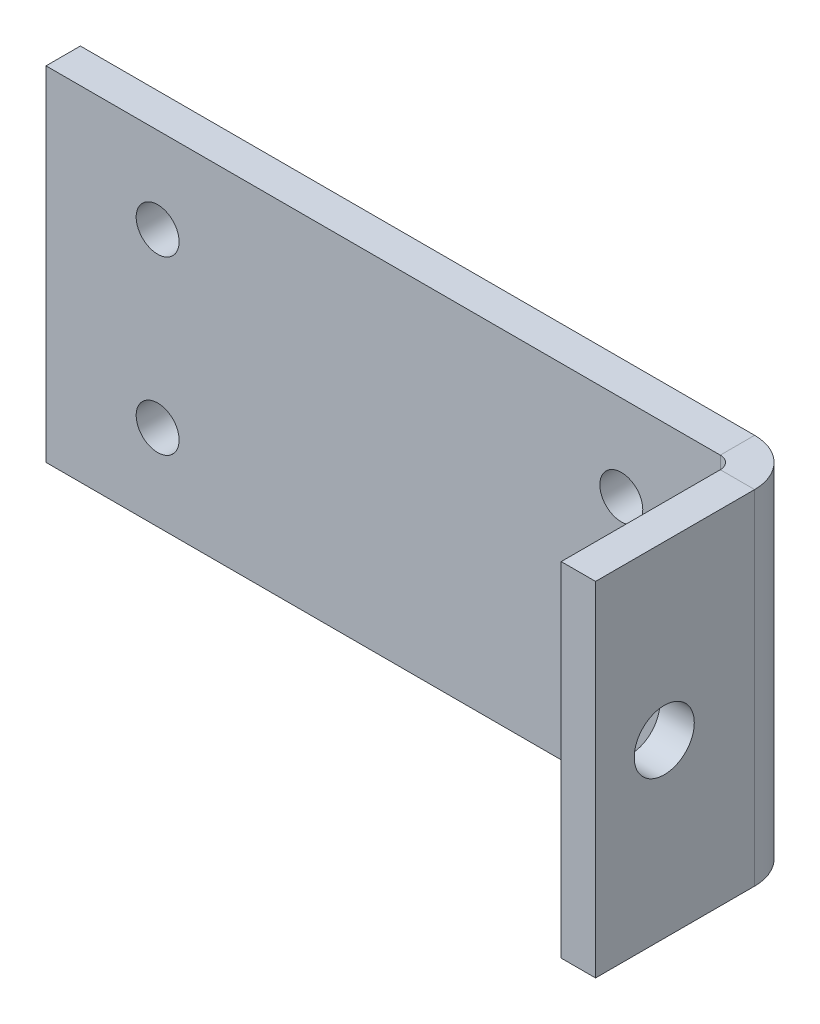
ISO-10303-21;
HEADER;
FILE_DESCRIPTION(('STEP AP214'),'2;1');
FILE_NAME('part.step','',(''),(''),'','','');
FILE_SCHEMA(('AUTOMOTIVE_DESIGN { 1 0 10303 214 1 1 1 1 }'));
ENDSEC;
DATA;
#1=APPLICATION_CONTEXT('core data for automotive mechanical design processes');
#2=APPLICATION_PROTOCOL_DEFINITION('international standard','automotive_design',2000,#1);
#3=PRODUCT_CONTEXT('',#1,'mechanical');
#4=PRODUCT('Part','Part','',(#3));
#5=PRODUCT_RELATED_PRODUCT_CATEGORY('part','',(#4));
#6=PRODUCT_DEFINITION_FORMATION('','',#4);
#7=PRODUCT_DEFINITION_CONTEXT('part definition',#1,'design');
#8=PRODUCT_DEFINITION('design','',#6,#7);
#9=PRODUCT_DEFINITION_SHAPE('','',#8);
#10=(LENGTH_UNIT() NAMED_UNIT(*) SI_UNIT(.MILLI.,.METRE.));
#11=(NAMED_UNIT(*) PLANE_ANGLE_UNIT() SI_UNIT($,.RADIAN.));
#12=(NAMED_UNIT(*) SI_UNIT($,.STERADIAN.) SOLID_ANGLE_UNIT());
#13=UNCERTAINTY_MEASURE_WITH_UNIT(LENGTH_MEASURE(1.E-05),#10,'distance_accuracy_value','');
#14=(GEOMETRIC_REPRESENTATION_CONTEXT(3) GLOBAL_UNCERTAINTY_ASSIGNED_CONTEXT((#13)) GLOBAL_UNIT_ASSIGNED_CONTEXT((#10,
#11,#12)) REPRESENTATION_CONTEXT('',''));
#15=CARTESIAN_POINT('',(0.,0.,0.));
#16=DIRECTION('',(0.,0.,1.));
#17=DIRECTION('',(1.,0.,0.));
#18=AXIS2_PLACEMENT_3D('',#15,#16,#17);
#19=CARTESIAN_POINT('',(-20.,10.,-2.));
#20=DIRECTION('',(0.,1.,0.));
#21=DIRECTION('',(-1.,0.,0.));
#22=AXIS2_PLACEMENT_3D('',#19,#20,#21);
#23=PLANE('',#22);
#24=DIRECTION('',(-1.,0.,0.));
#25=VECTOR('',#24,1.);
#26=CARTESIAN_POINT('',(-20.,10.,0.));
#27=LINE('',#26,#25);
#28=CARTESIAN_POINT('',(19.2634,10.,0.));
#29=VERTEX_POINT('',#28);
#30=CARTESIAN_POINT('',(-20.,10.,0.));
#31=VERTEX_POINT('',#30);
#32=EDGE_CURVE('E72',#29,#31,#27,.T.);
#33=ORIENTED_EDGE('',*,*,#32,.F.);
#34=DIRECTION('',(0.,0.,-1.));
#35=VECTOR('',#34,1.);
#36=CARTESIAN_POINT('',(19.2634,9.99999999999999,0.));
#37=LINE('',#36,#35);
#38=CARTESIAN_POINT('',(19.2634,9.99999999999999,-2.));
#39=VERTEX_POINT('',#38);
#40=EDGE_CURVE('E88',#29,#39,#37,.T.);
#41=ORIENTED_EDGE('',*,*,#40,.T.);
#42=DIRECTION('',(-1.,0.,0.));
#43=VECTOR('',#42,1.);
#44=CARTESIAN_POINT('',(-20.,10.,-2.));
#45=LINE('',#44,#43);
#46=CARTESIAN_POINT('',(-20.,10.,-2.));
#47=VERTEX_POINT('',#46);
#48=EDGE_CURVE('E61',#39,#47,#45,.T.);
#49=ORIENTED_EDGE('',*,*,#48,.T.);
#50=DIRECTION('',(0.,0.,1.));
#51=VECTOR('',#50,1.);
#52=CARTESIAN_POINT('',(-20.,10.,-2.));
#53=LINE('',#52,#51);
#54=EDGE_CURVE('E11',#47,#31,#53,.T.);
#55=ORIENTED_EDGE('',*,*,#54,.T.);
#56=EDGE_LOOP('',(#33,#41,#49,#55));
#57=FACE_BOUND('',#56,.T.);
#58=ADVANCED_FACE('F36',(#57),#23,.T.);
#59=CARTESIAN_POINT('',(0.,0.,-2.));
#60=DIRECTION('',(0.,0.,1.));
#61=DIRECTION('',(1.,0.,0.));
#62=AXIS2_PLACEMENT_3D('',#59,#60,#61);
#63=PLANE('',#62);
#64=CARTESIAN_POINT('',(-13.5,-5.,-2.));
#65=DIRECTION('',(0.,0.,1.));
#66=DIRECTION('',(1.,0.,0.));
#67=AXIS2_PLACEMENT_3D('',#64,#65,#66);
#68=CIRCLE('',#67,1.24999999999999);
#69=CARTESIAN_POINT('',(-12.25,-5.,-2.));
#70=VERTEX_POINT('',#69);
#71=EDGE_CURVE('E170',#70,#70,#68,.T.);
#72=ORIENTED_EDGE('',*,*,#71,.T.);
#73=EDGE_LOOP('',(#72));
#74=FACE_BOUND('',#73,.T.);
#75=CARTESIAN_POINT('',(13.5,-5.,-2.));
#76=DIRECTION('',(0.,0.,1.));
#77=DIRECTION('',(1.,0.,0.));
#78=AXIS2_PLACEMENT_3D('',#75,#76,#77);
#79=CIRCLE('',#78,1.24999999999999);
#80=CARTESIAN_POINT('',(14.75,-5.,-2.));
#81=VERTEX_POINT('',#80);
#82=EDGE_CURVE('E164',#81,#81,#79,.T.);
#83=ORIENTED_EDGE('',*,*,#82,.T.);
#84=EDGE_LOOP('',(#83));
#85=FACE_BOUND('',#84,.T.);
#86=CARTESIAN_POINT('',(13.5,5.,-2.));
#87=DIRECTION('',(0.,0.,1.));
#88=DIRECTION('',(1.,0.,0.));
#89=AXIS2_PLACEMENT_3D('',#86,#87,#88);
#90=CIRCLE('',#89,1.24999999999999);
#91=CARTESIAN_POINT('',(14.75,5.,-2.));
#92=VERTEX_POINT('',#91);
#93=EDGE_CURVE('E158',#92,#92,#90,.T.);
#94=ORIENTED_EDGE('',*,*,#93,.T.);
#95=EDGE_LOOP('',(#94));
#96=FACE_BOUND('',#95,.T.);
#97=CARTESIAN_POINT('',(-13.5,5.,-2.));
#98=DIRECTION('',(0.,0.,1.));
#99=DIRECTION('',(1.,0.,0.));
#100=AXIS2_PLACEMENT_3D('',#97,#98,#99);
#101=CIRCLE('',#100,1.24999999999999);
#102=CARTESIAN_POINT('',(-12.25,5.,-2.));
#103=VERTEX_POINT('',#102);
#104=EDGE_CURVE('E148',#103,#103,#101,.T.);
#105=ORIENTED_EDGE('',*,*,#104,.T.);
#106=EDGE_LOOP('',(#105));
#107=FACE_BOUND('',#106,.T.);
#108=DIRECTION('',(0.,1.,0.));
#109=VECTOR('',#108,1.);
#110=CARTESIAN_POINT('',(19.2634,10.,-2.));
#111=LINE('',#110,#109);
#112=CARTESIAN_POINT('',(19.2634,-9.99999999999998,-2.));
#113=VERTEX_POINT('',#112);
#114=EDGE_CURVE('E112',#39,#113,#111,.F.);
#115=ORIENTED_EDGE('',*,*,#114,.T.);
#116=DIRECTION('',(1.,0.,0.));
#117=VECTOR('',#116,1.);
#118=CARTESIAN_POINT('',(-20.,-10.,-2.));
#119=LINE('',#118,#117);
#120=CARTESIAN_POINT('',(-20.,-10.,-2.));
#121=VERTEX_POINT('',#120);
#122=EDGE_CURVE('E92',#121,#113,#119,.T.);
#123=ORIENTED_EDGE('',*,*,#122,.F.);
#124=DIRECTION('',(0.,-1.,0.));
#125=VECTOR('',#124,1.);
#126=CARTESIAN_POINT('',(-20.,10.,-2.));
#127=LINE('',#126,#125);
#128=EDGE_CURVE('E77',#47,#121,#127,.T.);
#129=ORIENTED_EDGE('',*,*,#128,.F.);
#130=ORIENTED_EDGE('',*,*,#48,.F.);
#131=EDGE_LOOP('',(#115,#123,#129,#130));
#132=FACE_BOUND('',#131,.T.);
#133=ADVANCED_FACE('F229',(#74,#85,#96,#107,#132),#63,.F.);
#134=CARTESIAN_POINT('',(0.,0.,0.));
#135=DIRECTION('',(0.,0.,1.));
#136=DIRECTION('',(1.,0.,0.));
#137=AXIS2_PLACEMENT_3D('',#134,#135,#136);
#138=PLANE('',#137);
#139=CARTESIAN_POINT('',(-13.5,-5.,0.));
#140=DIRECTION('',(0.,0.,1.));
#141=DIRECTION('',(1.,0.,0.));
#142=AXIS2_PLACEMENT_3D('',#139,#140,#141);
#143=CIRCLE('',#142,1.24999999999999);
#144=CARTESIAN_POINT('',(-12.25,-5.,0.));
#145=VERTEX_POINT('',#144);
#146=EDGE_CURVE('E173',#145,#145,#143,.T.);
#147=ORIENTED_EDGE('',*,*,#146,.F.);
#148=EDGE_LOOP('',(#147));
#149=FACE_BOUND('',#148,.T.);
#150=CARTESIAN_POINT('',(13.5,-5.,0.));
#151=DIRECTION('',(0.,0.,1.));
#152=DIRECTION('',(1.,0.,0.));
#153=AXIS2_PLACEMENT_3D('',#150,#151,#152);
#154=CIRCLE('',#153,1.24999999999999);
#155=CARTESIAN_POINT('',(14.75,-5.,0.));
#156=VERTEX_POINT('',#155);
#157=EDGE_CURVE('E167',#156,#156,#154,.T.);
#158=ORIENTED_EDGE('',*,*,#157,.F.);
#159=EDGE_LOOP('',(#158));
#160=FACE_BOUND('',#159,.T.);
#161=CARTESIAN_POINT('',(13.5,5.,0.));
#162=DIRECTION('',(0.,0.,1.));
#163=DIRECTION('',(1.,0.,0.));
#164=AXIS2_PLACEMENT_3D('',#161,#162,#163);
#165=CIRCLE('',#164,1.24999999999999);
#166=CARTESIAN_POINT('',(14.75,5.,0.));
#167=VERTEX_POINT('',#166);
#168=EDGE_CURVE('E161',#167,#167,#165,.T.);
#169=ORIENTED_EDGE('',*,*,#168,.F.);
#170=EDGE_LOOP('',(#169));
#171=FACE_BOUND('',#170,.T.);
#172=CARTESIAN_POINT('',(-13.5,5.,0.));
#173=DIRECTION('',(0.,0.,1.));
#174=DIRECTION('',(1.,0.,0.));
#175=AXIS2_PLACEMENT_3D('',#172,#173,#174);
#176=CIRCLE('',#175,1.24999999999999);
#177=CARTESIAN_POINT('',(-12.25,5.,0.));
#178=VERTEX_POINT('',#177);
#179=EDGE_CURVE('E155',#178,#178,#176,.T.);
#180=ORIENTED_EDGE('',*,*,#179,.F.);
#181=EDGE_LOOP('',(#180));
#182=FACE_BOUND('',#181,.T.);
#183=DIRECTION('',(1.,0.,0.));
#184=VECTOR('',#183,1.);
#185=CARTESIAN_POINT('',(-20.,-10.,0.));
#186=LINE('',#185,#184);
#187=CARTESIAN_POINT('',(-20.,-10.,0.));
#188=VERTEX_POINT('',#187);
#189=CARTESIAN_POINT('',(19.2634,-10.,0.));
#190=VERTEX_POINT('',#189);
#191=EDGE_CURVE('E78',#188,#190,#186,.T.);
#192=ORIENTED_EDGE('',*,*,#191,.T.);
#193=DIRECTION('',(0.,1.,0.));
#194=VECTOR('',#193,1.);
#195=CARTESIAN_POINT('',(19.2634,10.,0.));
#196=LINE('',#195,#194);
#197=EDGE_CURVE('E53',#29,#190,#196,.F.);
#198=ORIENTED_EDGE('',*,*,#197,.F.);
#199=ORIENTED_EDGE('',*,*,#32,.T.);
#200=DIRECTION('',(0.,-1.,0.));
#201=VECTOR('',#200,1.);
#202=CARTESIAN_POINT('',(-20.,10.,0.));
#203=LINE('',#202,#201);
#204=EDGE_CURVE('E75',#31,#188,#203,.T.);
#205=ORIENTED_EDGE('',*,*,#204,.T.);
#206=EDGE_LOOP('',(#192,#198,#199,#205));
#207=FACE_BOUND('',#206,.T.);
#208=ADVANCED_FACE('F73',(#149,#160,#171,#182,#207),#138,.T.);
#209=CARTESIAN_POINT('',(-20.,10.,-2.));
#210=DIRECTION('',(-1.,0.,0.));
#211=DIRECTION('',(0.,0.,1.));
#212=AXIS2_PLACEMENT_3D('',#209,#210,#211);
#213=PLANE('',#212);
#214=ORIENTED_EDGE('',*,*,#204,.F.);
#215=ORIENTED_EDGE('',*,*,#54,.F.);
#216=ORIENTED_EDGE('',*,*,#128,.T.);
#217=DIRECTION('',(0.,0.,1.));
#218=VECTOR('',#217,1.);
#219=CARTESIAN_POINT('',(-20.,-10.,-2.));
#220=LINE('',#219,#218);
#221=EDGE_CURVE('E45',#121,#188,#220,.T.);
#222=ORIENTED_EDGE('',*,*,#221,.T.);
#223=EDGE_LOOP('',(#214,#215,#216,#222));
#224=FACE_BOUND('',#223,.T.);
#225=ADVANCED_FACE('F38',(#224),#213,.T.);
#226=CARTESIAN_POINT('',(-20.,-10.,-2.));
#227=DIRECTION('',(0.,-1.,0.));
#228=DIRECTION('',(1.,0.,0.));
#229=AXIS2_PLACEMENT_3D('',#226,#227,#228);
#230=PLANE('',#229);
#231=DIRECTION('',(0.,0.,-1.));
#232=VECTOR('',#231,1.);
#233=CARTESIAN_POINT('',(19.2634,-10.,0.));
#234=LINE('',#233,#232);
#235=EDGE_CURVE('E84',#190,#113,#234,.T.);
#236=ORIENTED_EDGE('',*,*,#235,.F.);
#237=ORIENTED_EDGE('',*,*,#191,.F.);
#238=ORIENTED_EDGE('',*,*,#221,.F.);
#239=ORIENTED_EDGE('',*,*,#122,.T.);
#240=EDGE_LOOP('',(#236,#237,#238,#239));
#241=FACE_BOUND('',#240,.T.);
#242=ADVANCED_FACE('F261',(#241),#230,.T.);
#243=CARTESIAN_POINT('',(19.2634,-10.,0.7366));
#244=DIRECTION('',(0.,-1.,0.));
#245=DIRECTION('',(0.,0.,-1.));
#246=AXIS2_PLACEMENT_3D('',#243,#244,#245);
#247=PLANE('',#246);
#248=DIRECTION('',(1.,0.,0.));
#249=VECTOR('',#248,1.);
#250=CARTESIAN_POINT('',(20.,-10.,0.736599999999997));
#251=LINE('',#250,#249);
#252=CARTESIAN_POINT('',(20.,-10.,0.736599999999997));
#253=VERTEX_POINT('',#252);
#254=CARTESIAN_POINT('',(22.,-10.,0.73659999999999));
#255=VERTEX_POINT('',#254);
#256=EDGE_CURVE('E144',#253,#255,#251,.T.);
#257=ORIENTED_EDGE('',*,*,#256,.F.);
#258=CARTESIAN_POINT('',(19.2634,-10.,0.7366));
#259=DIRECTION('',(0.,1.,0.));
#260=DIRECTION('',(0.,0.,1.));
#261=AXIS2_PLACEMENT_3D('',#258,#259,#260);
#262=CIRCLE('',#261,0.7366);
#263=EDGE_CURVE('E106',#190,#253,#262,.F.);
#264=ORIENTED_EDGE('',*,*,#263,.F.);
#265=ORIENTED_EDGE('',*,*,#235,.T.);
#266=CARTESIAN_POINT('',(19.2634,-10.,0.7366));
#267=DIRECTION('',(0.,1.,0.));
#268=DIRECTION('',(0.,0.,1.));
#269=AXIS2_PLACEMENT_3D('',#266,#267,#268);
#270=CIRCLE('',#269,2.7366);
#271=EDGE_CURVE('E99',#113,#255,#270,.F.);
#272=ORIENTED_EDGE('',*,*,#271,.T.);
#273=EDGE_LOOP('',(#257,#264,#265,#272));
#274=FACE_BOUND('',#273,.T.);
#275=ADVANCED_FACE('F238',(#274),#247,.T.);
#276=CARTESIAN_POINT('',(19.2634,9.99999999999999,0.7366));
#277=DIRECTION('',(0.,-1.,0.));
#278=DIRECTION('',(0.,0.,-1.));
#279=AXIS2_PLACEMENT_3D('',#276,#277,#278);
#280=PLANE('',#279);
#281=CARTESIAN_POINT('',(19.2634,9.99999999999999,0.7366));
#282=DIRECTION('',(0.,1.,0.));
#283=DIRECTION('',(0.,0.,1.));
#284=AXIS2_PLACEMENT_3D('',#281,#282,#283);
#285=CIRCLE('',#284,0.7366);
#286=CARTESIAN_POINT('',(20.,9.99999999999999,0.736599999999997));
#287=VERTEX_POINT('',#286);
#288=EDGE_CURVE('E101',#287,#29,#285,.T.);
#289=ORIENTED_EDGE('',*,*,#288,.F.);
#290=DIRECTION('',(1.,0.,0.));
#291=VECTOR('',#290,1.);
#292=CARTESIAN_POINT('',(20.,9.99999999999999,0.736599999999997));
#293=LINE('',#292,#291);
#294=CARTESIAN_POINT('',(22.,9.99999999999999,0.73659999999999));
#295=VERTEX_POINT('',#294);
#296=EDGE_CURVE('E143',#287,#295,#293,.T.);
#297=ORIENTED_EDGE('',*,*,#296,.T.);
#298=CARTESIAN_POINT('',(19.2634,9.99999999999999,0.7366));
#299=DIRECTION('',(0.,1.,0.));
#300=DIRECTION('',(0.,0.,1.));
#301=AXIS2_PLACEMENT_3D('',#298,#299,#300);
#302=CIRCLE('',#301,2.7366);
#303=EDGE_CURVE('E109',#295,#39,#302,.T.);
#304=ORIENTED_EDGE('',*,*,#303,.T.);
#305=ORIENTED_EDGE('',*,*,#40,.F.);
#306=EDGE_LOOP('',(#289,#297,#304,#305));
#307=FACE_BOUND('',#306,.T.);
#308=ADVANCED_FACE('F236',(#307),#280,.F.);
#309=CARTESIAN_POINT('',(19.2634,10.,0.7366));
#310=DIRECTION('',(0.,1.,0.));
#311=DIRECTION('',(1.,0.,0.));
#312=AXIS2_PLACEMENT_3D('',#309,#310,#311);
#313=CYLINDRICAL_SURFACE('',#312,2.7366);
#314=ORIENTED_EDGE('',*,*,#114,.F.);
#315=ORIENTED_EDGE('',*,*,#303,.F.);
#316=DIRECTION('',(0.,-1.,0.));
#317=VECTOR('',#316,1.);
#318=CARTESIAN_POINT('',(22.,0.,0.73659999999999));
#319=LINE('',#318,#317);
#320=EDGE_CURVE('E133',#295,#255,#319,.T.);
#321=ORIENTED_EDGE('',*,*,#320,.T.);
#322=ORIENTED_EDGE('',*,*,#271,.F.);
#323=EDGE_LOOP('',(#314,#315,#321,#322));
#324=FACE_BOUND('',#323,.T.);
#325=ADVANCED_FACE('F233',(#324),#313,.T.);
#326=CARTESIAN_POINT('',(19.2634,10.,0.7366));
#327=DIRECTION('',(0.,1.,0.));
#328=DIRECTION('',(1.,0.,0.));
#329=AXIS2_PLACEMENT_3D('',#326,#327,#328);
#330=CYLINDRICAL_SURFACE('',#329,0.7366);
#331=ORIENTED_EDGE('',*,*,#197,.T.);
#332=ORIENTED_EDGE('',*,*,#263,.T.);
#333=DIRECTION('',(0.,1.,0.));
#334=VECTOR('',#333,1.);
#335=CARTESIAN_POINT('',(20.,-10.,0.736599999999997));
#336=LINE('',#335,#334);
#337=EDGE_CURVE('E147',#253,#287,#336,.T.);
#338=ORIENTED_EDGE('',*,*,#337,.T.);
#339=ORIENTED_EDGE('',*,*,#288,.T.);
#340=EDGE_LOOP('',(#331,#332,#338,#339));
#341=FACE_BOUND('',#340,.T.);
#342=ADVANCED_FACE('F243',(#341),#330,.F.);
#343=CARTESIAN_POINT('',(22.,-10.,0.));
#344=DIRECTION('',(0.,1.,0.));
#345=DIRECTION('',(0.,0.,1.));
#346=AXIS2_PLACEMENT_3D('',#343,#344,#345);
#347=PLANE('',#346);
#348=ORIENTED_EDGE('',*,*,#256,.T.);
#349=DIRECTION('',(0.,0.,-1.));
#350=VECTOR('',#349,1.);
#351=CARTESIAN_POINT('',(22.,-10.,0.));
#352=LINE('',#351,#350);
#353=CARTESIAN_POINT('',(22.,-10.,10.));
#354=VERTEX_POINT('',#353);
#355=EDGE_CURVE('E126',#354,#255,#352,.T.);
#356=ORIENTED_EDGE('',*,*,#355,.F.);
#357=DIRECTION('',(-1.,0.,0.));
#358=VECTOR('',#357,1.);
#359=CARTESIAN_POINT('',(22.,-10.,10.));
#360=LINE('',#359,#358);
#361=CARTESIAN_POINT('',(20.,-10.,10.));
#362=VERTEX_POINT('',#361);
#363=EDGE_CURVE('E119',#354,#362,#360,.T.);
#364=ORIENTED_EDGE('',*,*,#363,.T.);
#365=DIRECTION('',(0.,0.,-1.));
#366=VECTOR('',#365,1.);
#367=CARTESIAN_POINT('',(20.,-10.,0.));
#368=LINE('',#367,#366);
#369=EDGE_CURVE('E130',#362,#253,#368,.T.);
#370=ORIENTED_EDGE('',*,*,#369,.T.);
#371=EDGE_LOOP('',(#348,#356,#364,#370));
#372=FACE_BOUND('',#371,.T.);
#373=ADVANCED_FACE('F241',(#372),#347,.F.);
#374=CARTESIAN_POINT('',(22.,10.,10.));
#375=DIRECTION('',(0.,-1.,0.));
#376=DIRECTION('',(0.,0.,-1.));
#377=AXIS2_PLACEMENT_3D('',#374,#375,#376);
#378=PLANE('',#377);
#379=ORIENTED_EDGE('',*,*,#296,.F.);
#380=DIRECTION('',(0.,0.,1.));
#381=VECTOR('',#380,1.);
#382=CARTESIAN_POINT('',(20.,10.,10.));
#383=LINE('',#382,#381);
#384=CARTESIAN_POINT('',(20.,10.,10.));
#385=VERTEX_POINT('',#384);
#386=EDGE_CURVE('E127',#287,#385,#383,.T.);
#387=ORIENTED_EDGE('',*,*,#386,.T.);
#388=DIRECTION('',(-1.,0.,0.));
#389=VECTOR('',#388,1.);
#390=CARTESIAN_POINT('',(22.,10.,10.));
#391=LINE('',#390,#389);
#392=CARTESIAN_POINT('',(22.,10.,10.));
#393=VERTEX_POINT('',#392);
#394=EDGE_CURVE('E104',#393,#385,#391,.T.);
#395=ORIENTED_EDGE('',*,*,#394,.F.);
#396=DIRECTION('',(0.,0.,1.));
#397=VECTOR('',#396,1.);
#398=CARTESIAN_POINT('',(22.,10.,10.));
#399=LINE('',#398,#397);
#400=EDGE_CURVE('E136',#295,#393,#399,.T.);
#401=ORIENTED_EDGE('',*,*,#400,.F.);
#402=EDGE_LOOP('',(#379,#387,#395,#401));
#403=FACE_BOUND('',#402,.T.);
#404=ADVANCED_FACE('F203',(#403),#378,.F.);
#405=CARTESIAN_POINT('',(22.,0.,0.));
#406=DIRECTION('',(-1.,0.,0.));
#407=DIRECTION('',(0.,0.,1.));
#408=AXIS2_PLACEMENT_3D('',#405,#406,#407);
#409=PLANE('',#408);
#410=CARTESIAN_POINT('',(22.,0.,5.99999999999999));
#411=DIRECTION('',(1.,0.,0.));
#412=DIRECTION('',(0.,0.,-1.));
#413=AXIS2_PLACEMENT_3D('',#410,#411,#412);
#414=CIRCLE('',#413,1.74999999999999);
#415=CARTESIAN_POINT('',(22.,0.,4.25));
#416=VERTEX_POINT('',#415);
#417=EDGE_CURVE('E176',#416,#416,#414,.T.);
#418=ORIENTED_EDGE('',*,*,#417,.F.);
#419=EDGE_LOOP('',(#418));
#420=FACE_BOUND('',#419,.T.);
#421=ORIENTED_EDGE('',*,*,#320,.F.);
#422=ORIENTED_EDGE('',*,*,#400,.T.);
#423=DIRECTION('',(0.,-1.,0.));
#424=VECTOR('',#423,1.);
#425=CARTESIAN_POINT('',(22.,-10.,10.));
#426=LINE('',#425,#424);
#427=EDGE_CURVE('E122',#393,#354,#426,.T.);
#428=ORIENTED_EDGE('',*,*,#427,.T.);
#429=ORIENTED_EDGE('',*,*,#355,.T.);
#430=EDGE_LOOP('',(#421,#422,#428,#429));
#431=FACE_BOUND('',#430,.T.);
#432=ADVANCED_FACE('F189',(#420,#431),#409,.F.);
#433=CARTESIAN_POINT('',(20.,0.,0.));
#434=DIRECTION('',(-1.,0.,0.));
#435=DIRECTION('',(0.,0.,1.));
#436=AXIS2_PLACEMENT_3D('',#433,#434,#435);
#437=PLANE('',#436);
#438=CARTESIAN_POINT('',(20.,0.,6.));
#439=DIRECTION('',(-1.,0.,0.));
#440=DIRECTION('',(0.,0.,1.));
#441=AXIS2_PLACEMENT_3D('',#438,#439,#440);
#442=CIRCLE('',#441,1.74999999999999);
#443=CARTESIAN_POINT('',(20.,0.,7.74999999999999));
#444=VERTEX_POINT('',#443);
#445=EDGE_CURVE('E40',#444,#444,#442,.T.);
#446=ORIENTED_EDGE('',*,*,#445,.F.);
#447=EDGE_LOOP('',(#446));
#448=FACE_BOUND('',#447,.T.);
#449=ORIENTED_EDGE('',*,*,#386,.F.);
#450=ORIENTED_EDGE('',*,*,#337,.F.);
#451=ORIENTED_EDGE('',*,*,#369,.F.);
#452=DIRECTION('',(0.,-1.,0.));
#453=VECTOR('',#452,1.);
#454=CARTESIAN_POINT('',(20.,-10.,10.));
#455=LINE('',#454,#453);
#456=EDGE_CURVE('E123',#385,#362,#455,.T.);
#457=ORIENTED_EDGE('',*,*,#456,.F.);
#458=EDGE_LOOP('',(#449,#450,#451,#457));
#459=FACE_BOUND('',#458,.T.);
#460=ADVANCED_FACE('F185',(#448,#459),#437,.T.);
#461=CARTESIAN_POINT('',(22.,-10.,10.));
#462=DIRECTION('',(0.,0.,-1.));
#463=DIRECTION('',(-1.,0.,0.));
#464=AXIS2_PLACEMENT_3D('',#461,#462,#463);
#465=PLANE('',#464);
#466=ORIENTED_EDGE('',*,*,#456,.T.);
#467=ORIENTED_EDGE('',*,*,#363,.F.);
#468=ORIENTED_EDGE('',*,*,#427,.F.);
#469=ORIENTED_EDGE('',*,*,#394,.T.);
#470=EDGE_LOOP('',(#466,#467,#468,#469));
#471=FACE_BOUND('',#470,.T.);
#472=ADVANCED_FACE('F188',(#471),#465,.F.);
#473=CARTESIAN_POINT('',(-13.5,5.,0.));
#474=DIRECTION('',(0.,0.,1.));
#475=DIRECTION('',(1.,0.,0.));
#476=AXIS2_PLACEMENT_3D('',#473,#474,#475);
#477=CYLINDRICAL_SURFACE('',#476,1.24999999999999);
#478=ORIENTED_EDGE('',*,*,#104,.F.);
#479=EDGE_LOOP('',(#478));
#480=FACE_BOUND('',#479,.T.);
#481=ORIENTED_EDGE('',*,*,#179,.T.);
#482=EDGE_LOOP('',(#481));
#483=FACE_BOUND('',#482,.T.);
#484=ADVANCED_FACE('F282',(#480,#483),#477,.F.);
#485=CARTESIAN_POINT('',(13.5,5.,0.));
#486=DIRECTION('',(0.,0.,1.));
#487=DIRECTION('',(1.,0.,0.));
#488=AXIS2_PLACEMENT_3D('',#485,#486,#487);
#489=CYLINDRICAL_SURFACE('',#488,1.24999999999999);
#490=ORIENTED_EDGE('',*,*,#93,.F.);
#491=EDGE_LOOP('',(#490));
#492=FACE_BOUND('',#491,.T.);
#493=ORIENTED_EDGE('',*,*,#168,.T.);
#494=EDGE_LOOP('',(#493));
#495=FACE_BOUND('',#494,.T.);
#496=ADVANCED_FACE('F284',(#492,#495),#489,.F.);
#497=CARTESIAN_POINT('',(13.5,-5.,0.));
#498=DIRECTION('',(0.,0.,1.));
#499=DIRECTION('',(1.,0.,0.));
#500=AXIS2_PLACEMENT_3D('',#497,#498,#499);
#501=CYLINDRICAL_SURFACE('',#500,1.24999999999999);
#502=ORIENTED_EDGE('',*,*,#82,.F.);
#503=EDGE_LOOP('',(#502));
#504=FACE_BOUND('',#503,.T.);
#505=ORIENTED_EDGE('',*,*,#157,.T.);
#506=EDGE_LOOP('',(#505));
#507=FACE_BOUND('',#506,.T.);
#508=ADVANCED_FACE('F291',(#504,#507),#501,.F.);
#509=CARTESIAN_POINT('',(-13.5,-5.,0.));
#510=DIRECTION('',(0.,0.,1.));
#511=DIRECTION('',(1.,0.,0.));
#512=AXIS2_PLACEMENT_3D('',#509,#510,#511);
#513=CYLINDRICAL_SURFACE('',#512,1.24999999999999);
#514=ORIENTED_EDGE('',*,*,#71,.F.);
#515=EDGE_LOOP('',(#514));
#516=FACE_BOUND('',#515,.T.);
#517=ORIENTED_EDGE('',*,*,#146,.T.);
#518=EDGE_LOOP('',(#517));
#519=FACE_BOUND('',#518,.T.);
#520=ADVANCED_FACE('F347',(#516,#519),#513,.F.);
#521=CARTESIAN_POINT('',(22.,0.,5.99999999999999));
#522=DIRECTION('',(1.,0.,0.));
#523=DIRECTION('',(0.,0.,-1.));
#524=AXIS2_PLACEMENT_3D('',#521,#522,#523);
#525=CYLINDRICAL_SURFACE('',#524,1.74999999999999);
#526=ORIENTED_EDGE('',*,*,#445,.T.);
#527=EDGE_LOOP('',(#526));
#528=FACE_BOUND('',#527,.T.);
#529=ORIENTED_EDGE('',*,*,#417,.T.);
#530=EDGE_LOOP('',(#529));
#531=FACE_BOUND('',#530,.T.);
#532=ADVANCED_FACE('F183',(#528,#531),#525,.F.);
#533=CLOSED_SHELL('',(#58,#133,#208,#225,#242,#275,#308,#325,#342,#373,#404,#432,#460,#472,#484,
#496,#508,#520,#532));
#534=MANIFOLD_SOLID_BREP('B2',#533);
#535=ADVANCED_BREP_SHAPE_REPRESENTATION('',(#18,#534),#14);
#536=SHAPE_DEFINITION_REPRESENTATION(#9,#535);
ENDSEC;
END-ISO-10303-21;
